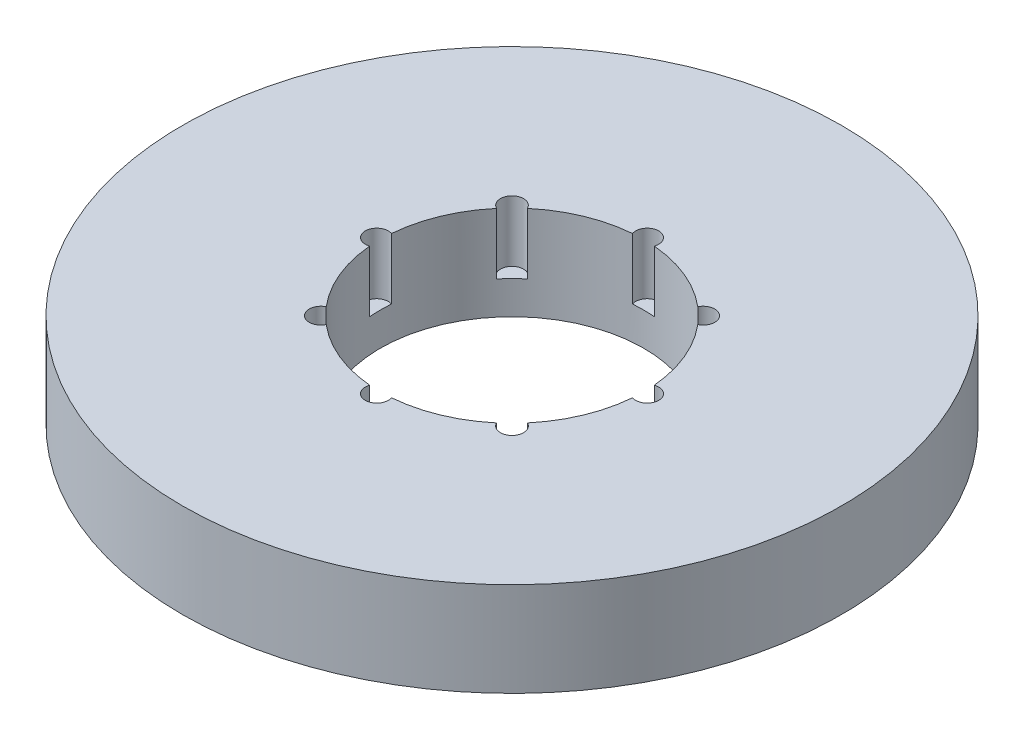
ISO-10303-21;
HEADER;
FILE_DESCRIPTION(('STEP AP214'),'2;1');
FILE_NAME('part.step','',(''),(''),'','','');
FILE_SCHEMA(('AUTOMOTIVE_DESIGN { 1 0 10303 214 1 1 1 1 }'));
ENDSEC;
DATA;
#1=APPLICATION_CONTEXT('core data for automotive mechanical design processes');
#2=APPLICATION_PROTOCOL_DEFINITION('international standard','automotive_design',2000,#1);
#3=PRODUCT_CONTEXT('',#1,'mechanical');
#4=PRODUCT('Part','Part','',(#3));
#5=PRODUCT_RELATED_PRODUCT_CATEGORY('part','',(#4));
#6=PRODUCT_DEFINITION_FORMATION('','',#4);
#7=PRODUCT_DEFINITION_CONTEXT('part definition',#1,'design');
#8=PRODUCT_DEFINITION('design','',#6,#7);
#9=PRODUCT_DEFINITION_SHAPE('','',#8);
#10=(LENGTH_UNIT() NAMED_UNIT(*) SI_UNIT(.MILLI.,.METRE.));
#11=(NAMED_UNIT(*) PLANE_ANGLE_UNIT() SI_UNIT($,.RADIAN.));
#12=(NAMED_UNIT(*) SI_UNIT($,.STERADIAN.) SOLID_ANGLE_UNIT());
#13=UNCERTAINTY_MEASURE_WITH_UNIT(LENGTH_MEASURE(1.E-05),#10,'distance_accuracy_value','');
#14=(GEOMETRIC_REPRESENTATION_CONTEXT(3) GLOBAL_UNCERTAINTY_ASSIGNED_CONTEXT((#13)) GLOBAL_UNIT_ASSIGNED_CONTEXT((#10,
#11,#12)) REPRESENTATION_CONTEXT('',''));
#15=CARTESIAN_POINT('',(0.,0.,0.));
#16=DIRECTION('',(0.,0.,1.));
#17=DIRECTION('',(1.,0.,0.));
#18=AXIS2_PLACEMENT_3D('',#15,#16,#17);
#19=CARTESIAN_POINT('',(0.,25.,0.));
#20=DIRECTION('',(0.,-1.,0.));
#21=DIRECTION('',(0.,0.,-1.));
#22=AXIS2_PLACEMENT_3D('',#19,#20,#21);
#23=CYLINDRICAL_SURFACE('',#22,87.5);
#24=CARTESIAN_POINT('',(0.,25.,0.));
#25=DIRECTION('',(0.,1.,0.));
#26=DIRECTION('',(0.,0.,1.));
#27=AXIS2_PLACEMENT_3D('',#24,#25,#26);
#28=CIRCLE('',#27,87.5);
#29=CARTESIAN_POINT('',(0.,25.,87.5));
#30=VERTEX_POINT('',#29);
#31=EDGE_CURVE('E195',#30,#30,#28,.T.);
#32=ORIENTED_EDGE('',*,*,#31,.F.);
#33=EDGE_LOOP('',(#32));
#34=FACE_BOUND('',#33,.T.);
#35=CARTESIAN_POINT('',(0.,0.,0.));
#36=DIRECTION('',(0.,1.,0.));
#37=DIRECTION('',(0.,0.,1.));
#38=AXIS2_PLACEMENT_3D('',#35,#36,#37);
#39=CIRCLE('',#38,87.5);
#40=CARTESIAN_POINT('',(0.,0.,87.5));
#41=VERTEX_POINT('',#40);
#42=EDGE_CURVE('E179',#41,#41,#39,.T.);
#43=ORIENTED_EDGE('',*,*,#42,.T.);
#44=EDGE_LOOP('',(#43));
#45=FACE_BOUND('',#44,.T.);
#46=ADVANCED_FACE('F39',(#34,#45),#23,.T.);
#47=CARTESIAN_POINT('',(0.,25.,0.));
#48=DIRECTION('',(0.,1.,0.));
#49=DIRECTION('',(0.,0.,1.));
#50=AXIS2_PLACEMENT_3D('',#47,#48,#49);
#51=PLANE('',#50);
#52=CARTESIAN_POINT('',(1.25330138786549E-13,25.,35.8959784181678));
#53=DIRECTION('',(0.,1.,0.));
#54=DIRECTION('',(1.,0.,0.));
#55=AXIS2_PLACEMENT_3D('',#52,#53,#54);
#56=CIRCLE('',#55,3.06589452444421);
#57=CARTESIAN_POINT('',(-2.89275118170886,25.,34.8802521579292));
#58=VERTEX_POINT('',#57);
#59=CARTESIAN_POINT('',(2.8927511817091,25.,34.8802521579292));
#60=VERTEX_POINT('',#59);
#61=EDGE_CURVE('E176',#58,#60,#56,.T.);
#62=ORIENTED_EDGE('',*,*,#61,.F.);
#63=CARTESIAN_POINT('',(0.,25.,0.));
#64=DIRECTION('',(0.,1.,0.));
#65=DIRECTION('',(0.,0.,1.));
#66=AXIS2_PLACEMENT_3D('',#63,#64,#65);
#67=CIRCLE('',#66,35.);
#68=CARTESIAN_POINT('',(-22.6185788534966,25.,26.7095468072403));
#69=VERTEX_POINT('',#68);
#70=EDGE_CURVE('E166',#69,#58,#67,.T.);
#71=ORIENTED_EDGE('',*,*,#70,.F.);
#72=CARTESIAN_POINT('',(-25.3822897568124,25.,25.3822897568124));
#73=DIRECTION('',(0.,1.,0.));
#74=DIRECTION('',(0.707106781186549,0.,0.707106781186546));
#75=AXIS2_PLACEMENT_3D('',#72,#73,#74);
#76=CIRCLE('',#75,3.06589452444421);
#77=CARTESIAN_POINT('',(-26.7095468072402,25.,22.6185788534966));
#78=VERTEX_POINT('',#77);
#79=EDGE_CURVE('E147',#78,#69,#76,.T.);
#80=ORIENTED_EDGE('',*,*,#79,.F.);
#81=CARTESIAN_POINT('',(-34.8802521579292,25.,2.89275118170898));
#82=VERTEX_POINT('',#81);
#83=EDGE_CURVE('E180',#82,#78,#67,.T.);
#84=ORIENTED_EDGE('',*,*,#83,.F.);
#85=CARTESIAN_POINT('',(-35.8959784181678,25.,0.));
#86=DIRECTION('',(0.,1.,0.));
#87=DIRECTION('',(0.,0.,1.));
#88=AXIS2_PLACEMENT_3D('',#85,#86,#87);
#89=CIRCLE('',#88,3.06589452444421);
#90=CARTESIAN_POINT('',(-34.8802521579292,25.,-2.89275118170898));
#91=VERTEX_POINT('',#90);
#92=EDGE_CURVE('E186',#91,#82,#89,.T.);
#93=ORIENTED_EDGE('',*,*,#92,.F.);
#94=CARTESIAN_POINT('',(-26.7095468072405,25.,-22.6185788534963));
#95=VERTEX_POINT('',#94);
#96=EDGE_CURVE('E182',#95,#91,#67,.T.);
#97=ORIENTED_EDGE('',*,*,#96,.F.);
#98=CARTESIAN_POINT('',(-25.3822897568127,25.,-25.3822897568121));
#99=DIRECTION('',(0.,1.,0.));
#100=DIRECTION('',(-0.707106781186539,0.,0.707106781186556));
#101=AXIS2_PLACEMENT_3D('',#98,#99,#100);
#102=CIRCLE('',#101,3.06589452444421);
#103=CARTESIAN_POINT('',(-22.6185788534969,25.,-26.70954680724));
#104=VERTEX_POINT('',#103);
#105=EDGE_CURVE('E446',#104,#95,#102,.T.);
#106=ORIENTED_EDGE('',*,*,#105,.F.);
#107=CARTESIAN_POINT('',(-2.89275118170935,25.,-34.8802521579291));
#108=VERTEX_POINT('',#107);
#109=EDGE_CURVE('E452',#108,#104,#67,.T.);
#110=ORIENTED_EDGE('',*,*,#109,.F.);
#111=CARTESIAN_POINT('',(-3.75990416359646E-13,25.,-35.8959784181678));
#112=DIRECTION('',(0.,1.,0.));
#113=DIRECTION('',(-1.,0.,0.));
#114=AXIS2_PLACEMENT_3D('',#111,#112,#113);
#115=CIRCLE('',#114,3.06589452444421);
#116=CARTESIAN_POINT('',(2.89275118170861,25.,-34.8802521579292));
#117=VERTEX_POINT('',#116);
#118=EDGE_CURVE('E477',#117,#108,#115,.T.);
#119=ORIENTED_EDGE('',*,*,#118,.F.);
#120=CARTESIAN_POINT('',(22.6185788534964,25.,-26.7095468072404));
#121=VERTEX_POINT('',#120);
#122=EDGE_CURVE('E460',#121,#117,#67,.T.);
#123=ORIENTED_EDGE('',*,*,#122,.F.);
#124=CARTESIAN_POINT('',(25.3822897568122,25.,-25.3822897568126));
#125=DIRECTION('',(0.,1.,0.));
#126=DIRECTION('',(-0.707106781186554,0.,-0.707106781186541));
#127=AXIS2_PLACEMENT_3D('',#124,#125,#126);
#128=CIRCLE('',#127,3.06589452444421);
#129=CARTESIAN_POINT('',(26.70954680724,25.,-22.6185788534968));
#130=VERTEX_POINT('',#129);
#131=EDGE_CURVE('E464',#130,#121,#128,.T.);
#132=ORIENTED_EDGE('',*,*,#131,.F.);
#133=CARTESIAN_POINT('',(34.8802521579292,25.,-2.89275118170898));
#134=VERTEX_POINT('',#133);
#135=EDGE_CURVE('E459',#134,#130,#67,.T.);
#136=ORIENTED_EDGE('',*,*,#135,.F.);
#137=CARTESIAN_POINT('',(35.8959784181678,25.,0.));
#138=DIRECTION('',(0.,1.,0.));
#139=DIRECTION('',(0.,0.,-1.));
#140=AXIS2_PLACEMENT_3D('',#137,#138,#139);
#141=CIRCLE('',#140,3.06589452444421);
#142=CARTESIAN_POINT('',(34.8802521579292,25.,2.89275118170898));
#143=VERTEX_POINT('',#142);
#144=EDGE_CURVE('E469',#143,#134,#141,.T.);
#145=ORIENTED_EDGE('',*,*,#144,.F.);
#146=CARTESIAN_POINT('',(26.7095468072404,25.,22.6185788534965));
#147=VERTEX_POINT('',#146);
#148=EDGE_CURVE('E181',#147,#143,#67,.T.);
#149=ORIENTED_EDGE('',*,*,#148,.F.);
#150=CARTESIAN_POINT('',(25.3822897568125,25.,25.3822897568123));
#151=DIRECTION('',(0.,1.,0.));
#152=DIRECTION('',(0.707106781186544,0.,-0.707106781186551));
#153=AXIS2_PLACEMENT_3D('',#150,#151,#152);
#154=CIRCLE('',#153,3.06589452444421);
#155=CARTESIAN_POINT('',(22.6185788534967,25.,26.7095468072401));
#156=VERTEX_POINT('',#155);
#157=EDGE_CURVE('E475',#156,#147,#154,.T.);
#158=ORIENTED_EDGE('',*,*,#157,.F.);
#159=EDGE_CURVE('E177',#60,#156,#67,.T.);
#160=ORIENTED_EDGE('',*,*,#159,.F.);
#161=EDGE_LOOP('',(#62,#71,#80,#84,#93,#97,#106,#110,#119,#123,#132,#136,#145,#149,#158,#160));
#162=FACE_BOUND('',#161,.T.);
#163=ORIENTED_EDGE('',*,*,#31,.T.);
#164=EDGE_LOOP('',(#163));
#165=FACE_BOUND('',#164,.T.);
#166=ADVANCED_FACE('F172',(#162,#165),#51,.T.);
#167=CARTESIAN_POINT('',(0.,0.,0.));
#168=DIRECTION('',(0.,1.,0.));
#169=DIRECTION('',(0.,0.,1.));
#170=AXIS2_PLACEMENT_3D('',#167,#168,#169);
#171=PLANE('',#170);
#172=CARTESIAN_POINT('',(0.,0.,0.));
#173=DIRECTION('',(0.,1.,0.));
#174=DIRECTION('',(0.,0.,1.));
#175=AXIS2_PLACEMENT_3D('',#172,#173,#174);
#176=CIRCLE('',#175,35.);
#177=CARTESIAN_POINT('',(0.,0.,35.));
#178=VERTEX_POINT('',#177);
#179=EDGE_CURVE('E187',#178,#178,#176,.T.);
#180=ORIENTED_EDGE('',*,*,#179,.T.);
#181=EDGE_LOOP('',(#180));
#182=FACE_BOUND('',#181,.T.);
#183=ORIENTED_EDGE('',*,*,#42,.F.);
#184=EDGE_LOOP('',(#183));
#185=FACE_BOUND('',#184,.T.);
#186=ADVANCED_FACE('F270',(#182,#185),#171,.F.);
#187=CARTESIAN_POINT('',(0.,25.,0.));
#188=DIRECTION('',(0.,-1.,0.));
#189=DIRECTION('',(0.,0.,-1.));
#190=AXIS2_PLACEMENT_3D('',#187,#188,#189);
#191=CYLINDRICAL_SURFACE('',#190,35.);
#192=DIRECTION('',(0.,1.,0.));
#193=VECTOR('',#192,1.);
#194=CARTESIAN_POINT('',(-2.89275118170886,16.8888974766412,34.8802521579292));
#195=LINE('',#194,#193);
#196=CARTESIAN_POINT('',(-2.89275118170886,8.77779495328235,34.8802521579292));
#197=VERTEX_POINT('',#196);
#198=EDGE_CURVE('E11',#197,#58,#195,.T.);
#199=ORIENTED_EDGE('',*,*,#198,.F.);
#200=CARTESIAN_POINT('',(0.,8.77779495328235,0.));
#201=DIRECTION('',(0.,1.,0.));
#202=DIRECTION('',(0.,0.,1.));
#203=AXIS2_PLACEMENT_3D('',#200,#201,#202);
#204=CIRCLE('',#203,35.);
#205=CARTESIAN_POINT('',(2.8927511817091,8.77779495328235,34.8802521579292));
#206=VERTEX_POINT('',#205);
#207=EDGE_CURVE('E250',#197,#206,#204,.T.);
#208=ORIENTED_EDGE('',*,*,#207,.T.);
#209=DIRECTION('',(0.,1.,0.));
#210=VECTOR('',#209,1.);
#211=CARTESIAN_POINT('',(2.8927511817091,16.8888974766412,34.8802521579291));
#212=LINE('',#211,#210);
#213=EDGE_CURVE('E46',#60,#206,#212,.F.);
#214=ORIENTED_EDGE('',*,*,#213,.F.);
#215=ORIENTED_EDGE('',*,*,#159,.T.);
#216=DIRECTION('',(0.,1.,0.));
#217=VECTOR('',#216,1.);
#218=CARTESIAN_POINT('',(22.6185788534967,16.8888974766412,26.7095468072401));
#219=LINE('',#218,#217);
#220=CARTESIAN_POINT('',(22.6185788534967,8.77779495328235,26.7095468072401));
#221=VERTEX_POINT('',#220);
#222=EDGE_CURVE('E244',#221,#156,#219,.T.);
#223=ORIENTED_EDGE('',*,*,#222,.F.);
#224=CARTESIAN_POINT('',(0.,8.77779495328235,0.));
#225=DIRECTION('',(0.,1.,0.));
#226=DIRECTION('',(0.,0.,1.));
#227=AXIS2_PLACEMENT_3D('',#224,#225,#226);
#228=CIRCLE('',#227,35.);
#229=CARTESIAN_POINT('',(26.7095468072404,8.77779495328235,22.6185788534965));
#230=VERTEX_POINT('',#229);
#231=EDGE_CURVE('E238',#221,#230,#228,.T.);
#232=ORIENTED_EDGE('',*,*,#231,.T.);
#233=DIRECTION('',(0.,1.,0.));
#234=VECTOR('',#233,1.);
#235=CARTESIAN_POINT('',(26.7095468072403,16.8888974766412,22.6185788534965));
#236=LINE('',#235,#234);
#237=EDGE_CURVE('E242',#147,#230,#236,.F.);
#238=ORIENTED_EDGE('',*,*,#237,.F.);
#239=ORIENTED_EDGE('',*,*,#148,.T.);
#240=DIRECTION('',(0.,1.,0.));
#241=VECTOR('',#240,1.);
#242=CARTESIAN_POINT('',(34.8802521579292,16.8888974766412,2.89275118170898));
#243=LINE('',#242,#241);
#244=CARTESIAN_POINT('',(34.8802521579292,8.77779495328235,2.89275118170898));
#245=VERTEX_POINT('',#244);
#246=EDGE_CURVE('E236',#245,#143,#243,.T.);
#247=ORIENTED_EDGE('',*,*,#246,.F.);
#248=CARTESIAN_POINT('',(0.,8.77779495328235,0.));
#249=DIRECTION('',(0.,1.,0.));
#250=DIRECTION('',(0.,0.,1.));
#251=AXIS2_PLACEMENT_3D('',#248,#249,#250);
#252=CIRCLE('',#251,35.);
#253=CARTESIAN_POINT('',(34.8802521579292,8.77779495328235,-2.89275118170898));
#254=VERTEX_POINT('',#253);
#255=EDGE_CURVE('E235',#245,#254,#252,.T.);
#256=ORIENTED_EDGE('',*,*,#255,.T.);
#257=DIRECTION('',(0.,1.,0.));
#258=VECTOR('',#257,1.);
#259=CARTESIAN_POINT('',(34.8802521579292,16.8888974766412,-2.89275118170898));
#260=LINE('',#259,#258);
#261=EDGE_CURVE('E234',#134,#254,#260,.F.);
#262=ORIENTED_EDGE('',*,*,#261,.F.);
#263=ORIENTED_EDGE('',*,*,#135,.T.);
#264=DIRECTION('',(0.,1.,0.));
#265=VECTOR('',#264,1.);
#266=CARTESIAN_POINT('',(26.70954680724,16.8888974766412,-22.6185788534968));
#267=LINE('',#266,#265);
#268=CARTESIAN_POINT('',(26.70954680724,8.77779495328235,-22.6185788534968));
#269=VERTEX_POINT('',#268);
#270=EDGE_CURVE('E229',#269,#130,#267,.T.);
#271=ORIENTED_EDGE('',*,*,#270,.F.);
#272=CARTESIAN_POINT('',(0.,8.77779495328235,0.));
#273=DIRECTION('',(0.,1.,0.));
#274=DIRECTION('',(0.,0.,1.));
#275=AXIS2_PLACEMENT_3D('',#272,#273,#274);
#276=CIRCLE('',#275,35.);
#277=CARTESIAN_POINT('',(22.6185788534964,8.77779495328235,-26.7095468072404));
#278=VERTEX_POINT('',#277);
#279=EDGE_CURVE('E221',#269,#278,#276,.T.);
#280=ORIENTED_EDGE('',*,*,#279,.T.);
#281=DIRECTION('',(0.,1.,0.));
#282=VECTOR('',#281,1.);
#283=CARTESIAN_POINT('',(22.6185788534964,16.8888974766412,-26.7095468072404));
#284=LINE('',#283,#282);
#285=EDGE_CURVE('E230',#121,#278,#284,.F.);
#286=ORIENTED_EDGE('',*,*,#285,.F.);
#287=ORIENTED_EDGE('',*,*,#122,.T.);
#288=DIRECTION('',(0.,1.,0.));
#289=VECTOR('',#288,1.);
#290=CARTESIAN_POINT('',(2.89275118170861,16.8888974766412,-34.8802521579292));
#291=LINE('',#290,#289);
#292=CARTESIAN_POINT('',(2.89275118170861,8.77779495328235,-34.8802521579292));
#293=VERTEX_POINT('',#292);
#294=EDGE_CURVE('E225',#293,#117,#291,.T.);
#295=ORIENTED_EDGE('',*,*,#294,.F.);
#296=CARTESIAN_POINT('',(0.,8.77779495328235,0.));
#297=DIRECTION('',(0.,1.,0.));
#298=DIRECTION('',(0.,0.,1.));
#299=AXIS2_PLACEMENT_3D('',#296,#297,#298);
#300=CIRCLE('',#299,35.);
#301=CARTESIAN_POINT('',(-2.89275118170935,8.77779495328235,-34.8802521579291));
#302=VERTEX_POINT('',#301);
#303=EDGE_CURVE('E216',#293,#302,#300,.T.);
#304=ORIENTED_EDGE('',*,*,#303,.T.);
#305=DIRECTION('',(0.,1.,0.));
#306=VECTOR('',#305,1.);
#307=CARTESIAN_POINT('',(-2.89275118170934,16.8888974766412,-34.8802521579291));
#308=LINE('',#307,#306);
#309=EDGE_CURVE('E218',#108,#302,#308,.F.);
#310=ORIENTED_EDGE('',*,*,#309,.F.);
#311=ORIENTED_EDGE('',*,*,#109,.T.);
#312=DIRECTION('',(0.,1.,0.));
#313=VECTOR('',#312,1.);
#314=CARTESIAN_POINT('',(-22.6185788534969,16.8888974766412,-26.70954680724));
#315=LINE('',#314,#313);
#316=CARTESIAN_POINT('',(-22.6185788534969,8.77779495328235,-26.70954680724));
#317=VERTEX_POINT('',#316);
#318=EDGE_CURVE('E212',#317,#104,#315,.T.);
#319=ORIENTED_EDGE('',*,*,#318,.F.);
#320=CARTESIAN_POINT('',(0.,8.77779495328235,0.));
#321=DIRECTION('',(0.,1.,0.));
#322=DIRECTION('',(0.,0.,1.));
#323=AXIS2_PLACEMENT_3D('',#320,#321,#322);
#324=CIRCLE('',#323,35.);
#325=CARTESIAN_POINT('',(-26.7095468072405,8.77779495328235,-22.6185788534963));
#326=VERTEX_POINT('',#325);
#327=EDGE_CURVE('E208',#317,#326,#324,.T.);
#328=ORIENTED_EDGE('',*,*,#327,.T.);
#329=DIRECTION('',(0.,1.,0.));
#330=VECTOR('',#329,1.);
#331=CARTESIAN_POINT('',(-26.7095468072405,16.8888974766412,-22.6185788534963));
#332=LINE('',#331,#330);
#333=EDGE_CURVE('E211',#95,#326,#332,.F.);
#334=ORIENTED_EDGE('',*,*,#333,.F.);
#335=ORIENTED_EDGE('',*,*,#96,.T.);
#336=DIRECTION('',(0.,1.,0.));
#337=VECTOR('',#336,1.);
#338=CARTESIAN_POINT('',(-34.8802521579292,16.8888974766412,-2.89275118170898));
#339=LINE('',#338,#337);
#340=CARTESIAN_POINT('',(-34.8802521579292,8.77779495328235,-2.89275118170898));
#341=VERTEX_POINT('',#340);
#342=EDGE_CURVE('E201',#341,#91,#339,.T.);
#343=ORIENTED_EDGE('',*,*,#342,.F.);
#344=CARTESIAN_POINT('',(0.,8.77779495328235,0.));
#345=DIRECTION('',(0.,1.,0.));
#346=DIRECTION('',(0.,0.,1.));
#347=AXIS2_PLACEMENT_3D('',#344,#345,#346);
#348=CIRCLE('',#347,35.);
#349=CARTESIAN_POINT('',(-34.8802521579292,8.77779495328235,2.89275118170898));
#350=VERTEX_POINT('',#349);
#351=EDGE_CURVE('E194',#341,#350,#348,.T.);
#352=ORIENTED_EDGE('',*,*,#351,.T.);
#353=DIRECTION('',(0.,1.,0.));
#354=VECTOR('',#353,1.);
#355=CARTESIAN_POINT('',(-34.8802521579292,16.8888974766412,2.89275118170898));
#356=LINE('',#355,#354);
#357=EDGE_CURVE('E199',#82,#350,#356,.F.);
#358=ORIENTED_EDGE('',*,*,#357,.F.);
#359=ORIENTED_EDGE('',*,*,#83,.T.);
#360=DIRECTION('',(0.,1.,0.));
#361=VECTOR('',#360,1.);
#362=CARTESIAN_POINT('',(-26.7095468072402,16.8888974766412,22.6185788534966));
#363=LINE('',#362,#361);
#364=CARTESIAN_POINT('',(-26.7095468072402,8.77779495328235,22.6185788534966));
#365=VERTEX_POINT('',#364);
#366=EDGE_CURVE('E160',#365,#78,#363,.T.);
#367=ORIENTED_EDGE('',*,*,#366,.F.);
#368=CARTESIAN_POINT('',(0.,8.77779495328235,0.));
#369=DIRECTION('',(0.,1.,0.));
#370=DIRECTION('',(0.,0.,1.));
#371=AXIS2_PLACEMENT_3D('',#368,#369,#370);
#372=CIRCLE('',#371,35.);
#373=CARTESIAN_POINT('',(-22.6185788534966,8.77779495328235,26.7095468072403));
#374=VERTEX_POINT('',#373);
#375=EDGE_CURVE('E168',#365,#374,#372,.T.);
#376=ORIENTED_EDGE('',*,*,#375,.T.);
#377=DIRECTION('',(0.,1.,0.));
#378=VECTOR('',#377,1.);
#379=CARTESIAN_POINT('',(-22.6185788534966,16.8888974766412,26.7095468072403));
#380=LINE('',#379,#378);
#381=EDGE_CURVE('E152',#69,#374,#380,.F.);
#382=ORIENTED_EDGE('',*,*,#381,.F.);
#383=ORIENTED_EDGE('',*,*,#70,.T.);
#384=EDGE_LOOP('',(#199,#208,#214,#215,#223,#232,#238,#239,#247,#256,#262,#263,#271,#280,#286,
#287,#295,#304,#310,#311,#319,#328,#334,#335,#343,#352,#358,#359,#367,#376,#382,#383));
#385=FACE_BOUND('',#384,.T.);
#386=ORIENTED_EDGE('',*,*,#179,.F.);
#387=EDGE_LOOP('',(#386));
#388=FACE_BOUND('',#387,.T.);
#389=ADVANCED_FACE('F170',(#385,#388),#191,.F.);
#390=CARTESIAN_POINT('',(-35.8959784181678,8.77779495328235,0.));
#391=DIRECTION('',(0.,1.,0.));
#392=DIRECTION('',(0.,0.,1.));
#393=AXIS2_PLACEMENT_3D('',#390,#391,#392);
#394=CYLINDRICAL_SURFACE('',#393,3.06589452444421);
#395=ORIENTED_EDGE('',*,*,#342,.T.);
#396=ORIENTED_EDGE('',*,*,#92,.T.);
#397=ORIENTED_EDGE('',*,*,#357,.T.);
#398=CARTESIAN_POINT('',(-35.8959784181678,8.77779495328235,0.));
#399=DIRECTION('',(0.,1.,0.));
#400=DIRECTION('',(0.,0.,1.));
#401=AXIS2_PLACEMENT_3D('',#398,#399,#400);
#402=CIRCLE('',#401,3.06589452444421);
#403=EDGE_CURVE('E191',#341,#350,#402,.T.);
#404=ORIENTED_EDGE('',*,*,#403,.F.);
#405=EDGE_LOOP('',(#395,#396,#397,#404));
#406=FACE_BOUND('',#405,.T.);
#407=ADVANCED_FACE('F279',(#406),#394,.F.);
#408=CARTESIAN_POINT('',(-35.8959784181678,8.77779495328235,0.));
#409=DIRECTION('',(0.,1.,0.));
#410=DIRECTION('',(0.,0.,1.));
#411=AXIS2_PLACEMENT_3D('',#408,#409,#410);
#412=PLANE('',#411);
#413=ORIENTED_EDGE('',*,*,#403,.T.);
#414=ORIENTED_EDGE('',*,*,#351,.F.);
#415=EDGE_LOOP('',(#413,#414));
#416=FACE_BOUND('',#415,.T.);
#417=ADVANCED_FACE('F285',(#416),#412,.T.);
#418=CARTESIAN_POINT('',(-25.3822897568124,8.77779495328235,25.3822897568124));
#419=DIRECTION('',(0.,1.,0.));
#420=DIRECTION('',(0.,0.,1.));
#421=AXIS2_PLACEMENT_3D('',#418,#419,#420);
#422=CYLINDRICAL_SURFACE('',#421,3.06589452444421);
#423=ORIENTED_EDGE('',*,*,#366,.T.);
#424=ORIENTED_EDGE('',*,*,#79,.T.);
#425=ORIENTED_EDGE('',*,*,#381,.T.);
#426=CARTESIAN_POINT('',(-25.3822897568124,8.77779495328235,25.3822897568124));
#427=DIRECTION('',(0.,1.,0.));
#428=DIRECTION('',(0.707106781186549,0.,0.707106781186546));
#429=AXIS2_PLACEMENT_3D('',#426,#427,#428);
#430=CIRCLE('',#429,3.06589452444421);
#431=EDGE_CURVE('E165',#365,#374,#430,.T.);
#432=ORIENTED_EDGE('',*,*,#431,.F.);
#433=EDGE_LOOP('',(#423,#424,#425,#432));
#434=FACE_BOUND('',#433,.T.);
#435=ADVANCED_FACE('F155',(#434),#422,.F.);
#436=CARTESIAN_POINT('',(-25.3822897568124,8.77779495328235,25.3822897568124));
#437=DIRECTION('',(0.,1.,0.));
#438=DIRECTION('',(0.707106781186549,0.,0.707106781186546));
#439=AXIS2_PLACEMENT_3D('',#436,#437,#438);
#440=PLANE('',#439);
#441=ORIENTED_EDGE('',*,*,#431,.T.);
#442=ORIENTED_EDGE('',*,*,#375,.F.);
#443=EDGE_LOOP('',(#441,#442));
#444=FACE_BOUND('',#443,.T.);
#445=ADVANCED_FACE('F288',(#444),#440,.T.);
#446=CARTESIAN_POINT('',(-25.3822897568127,8.77779495328235,-25.3822897568121));
#447=DIRECTION('',(0.,1.,0.));
#448=DIRECTION('',(0.,0.,1.));
#449=AXIS2_PLACEMENT_3D('',#446,#447,#448);
#450=CYLINDRICAL_SURFACE('',#449,3.06589452444421);
#451=ORIENTED_EDGE('',*,*,#318,.T.);
#452=ORIENTED_EDGE('',*,*,#105,.T.);
#453=ORIENTED_EDGE('',*,*,#333,.T.);
#454=CARTESIAN_POINT('',(-25.3822897568127,8.77779495328235,-25.3822897568121));
#455=DIRECTION('',(0.,1.,0.));
#456=DIRECTION('',(-0.707106781186539,0.,0.707106781186556));
#457=AXIS2_PLACEMENT_3D('',#454,#455,#456);
#458=CIRCLE('',#457,3.06589452444421);
#459=EDGE_CURVE('E447',#317,#326,#458,.T.);
#460=ORIENTED_EDGE('',*,*,#459,.F.);
#461=EDGE_LOOP('',(#451,#452,#453,#460));
#462=FACE_BOUND('',#461,.T.);
#463=ADVANCED_FACE('F295',(#462),#450,.F.);
#464=CARTESIAN_POINT('',(-25.3822897568127,8.77779495328235,-25.3822897568121));
#465=DIRECTION('',(0.,1.,0.));
#466=DIRECTION('',(-0.707106781186539,0.,0.707106781186556));
#467=AXIS2_PLACEMENT_3D('',#464,#465,#466);
#468=PLANE('',#467);
#469=ORIENTED_EDGE('',*,*,#459,.T.);
#470=ORIENTED_EDGE('',*,*,#327,.F.);
#471=EDGE_LOOP('',(#469,#470));
#472=FACE_BOUND('',#471,.T.);
#473=ADVANCED_FACE('F375',(#472),#468,.T.);
#474=CARTESIAN_POINT('',(-3.75990416359646E-13,8.77779495328235,-35.8959784181678));
#475=DIRECTION('',(0.,1.,0.));
#476=DIRECTION('',(0.,0.,1.));
#477=AXIS2_PLACEMENT_3D('',#474,#475,#476);
#478=CYLINDRICAL_SURFACE('',#477,3.06589452444421);
#479=ORIENTED_EDGE('',*,*,#294,.T.);
#480=ORIENTED_EDGE('',*,*,#118,.T.);
#481=ORIENTED_EDGE('',*,*,#309,.T.);
#482=CARTESIAN_POINT('',(-3.75990416359646E-13,8.77779495328235,-35.8959784181678));
#483=DIRECTION('',(0.,1.,0.));
#484=DIRECTION('',(-1.,0.,0.));
#485=AXIS2_PLACEMENT_3D('',#482,#483,#484);
#486=CIRCLE('',#485,3.06589452444421);
#487=EDGE_CURVE('E467',#293,#302,#486,.T.);
#488=ORIENTED_EDGE('',*,*,#487,.F.);
#489=EDGE_LOOP('',(#479,#480,#481,#488));
#490=FACE_BOUND('',#489,.T.);
#491=ADVANCED_FACE('F361',(#490),#478,.F.);
#492=CARTESIAN_POINT('',(-3.75990416359646E-13,8.77779495328235,-35.8959784181678));
#493=DIRECTION('',(0.,1.,0.));
#494=DIRECTION('',(-1.,0.,0.));
#495=AXIS2_PLACEMENT_3D('',#492,#493,#494);
#496=PLANE('',#495);
#497=ORIENTED_EDGE('',*,*,#487,.T.);
#498=ORIENTED_EDGE('',*,*,#303,.F.);
#499=EDGE_LOOP('',(#497,#498));
#500=FACE_BOUND('',#499,.T.);
#501=ADVANCED_FACE('F297',(#500),#496,.T.);
#502=CARTESIAN_POINT('',(25.3822897568122,8.77779495328235,-25.3822897568126));
#503=DIRECTION('',(0.,1.,0.));
#504=DIRECTION('',(0.,0.,1.));
#505=AXIS2_PLACEMENT_3D('',#502,#503,#504);
#506=CYLINDRICAL_SURFACE('',#505,3.06589452444421);
#507=ORIENTED_EDGE('',*,*,#270,.T.);
#508=ORIENTED_EDGE('',*,*,#131,.T.);
#509=ORIENTED_EDGE('',*,*,#285,.T.);
#510=CARTESIAN_POINT('',(25.3822897568122,8.77779495328235,-25.3822897568126));
#511=DIRECTION('',(0.,1.,0.));
#512=DIRECTION('',(-0.707106781186554,0.,-0.707106781186541));
#513=AXIS2_PLACEMENT_3D('',#510,#511,#512);
#514=CIRCLE('',#513,3.06589452444421);
#515=EDGE_CURVE('E470',#269,#278,#514,.T.);
#516=ORIENTED_EDGE('',*,*,#515,.F.);
#517=EDGE_LOOP('',(#507,#508,#509,#516));
#518=FACE_BOUND('',#517,.T.);
#519=ADVANCED_FACE('F294',(#518),#506,.F.);
#520=CARTESIAN_POINT('',(25.3822897568122,8.77779495328235,-25.3822897568126));
#521=DIRECTION('',(0.,1.,0.));
#522=DIRECTION('',(-0.707106781186554,0.,-0.707106781186541));
#523=AXIS2_PLACEMENT_3D('',#520,#521,#522);
#524=PLANE('',#523);
#525=ORIENTED_EDGE('',*,*,#515,.T.);
#526=ORIENTED_EDGE('',*,*,#279,.F.);
#527=EDGE_LOOP('',(#525,#526));
#528=FACE_BOUND('',#527,.T.);
#529=ADVANCED_FACE('F300',(#528),#524,.T.);
#530=CARTESIAN_POINT('',(35.8959784181678,8.77779495328235,0.));
#531=DIRECTION('',(0.,1.,0.));
#532=DIRECTION('',(0.,0.,1.));
#533=AXIS2_PLACEMENT_3D('',#530,#531,#532);
#534=CYLINDRICAL_SURFACE('',#533,3.06589452444421);
#535=ORIENTED_EDGE('',*,*,#246,.T.);
#536=ORIENTED_EDGE('',*,*,#144,.T.);
#537=ORIENTED_EDGE('',*,*,#261,.T.);
#538=CARTESIAN_POINT('',(35.8959784181678,8.77779495328235,0.));
#539=DIRECTION('',(0.,1.,0.));
#540=DIRECTION('',(0.,0.,-1.));
#541=AXIS2_PLACEMENT_3D('',#538,#539,#540);
#542=CIRCLE('',#541,3.06589452444421);
#543=EDGE_CURVE('E472',#245,#254,#542,.T.);
#544=ORIENTED_EDGE('',*,*,#543,.F.);
#545=EDGE_LOOP('',(#535,#536,#537,#544));
#546=FACE_BOUND('',#545,.T.);
#547=ADVANCED_FACE('F305',(#546),#534,.F.);
#548=CARTESIAN_POINT('',(35.8959784181678,8.77779495328235,0.));
#549=DIRECTION('',(0.,1.,0.));
#550=DIRECTION('',(0.,0.,-1.));
#551=AXIS2_PLACEMENT_3D('',#548,#549,#550);
#552=PLANE('',#551);
#553=ORIENTED_EDGE('',*,*,#543,.T.);
#554=ORIENTED_EDGE('',*,*,#255,.F.);
#555=EDGE_LOOP('',(#553,#554));
#556=FACE_BOUND('',#555,.T.);
#557=ADVANCED_FACE('F308',(#556),#552,.T.);
#558=CARTESIAN_POINT('',(25.3822897568125,8.77779495328235,25.3822897568123));
#559=DIRECTION('',(0.,1.,0.));
#560=DIRECTION('',(0.,0.,1.));
#561=AXIS2_PLACEMENT_3D('',#558,#559,#560);
#562=CYLINDRICAL_SURFACE('',#561,3.06589452444421);
#563=ORIENTED_EDGE('',*,*,#222,.T.);
#564=ORIENTED_EDGE('',*,*,#157,.T.);
#565=ORIENTED_EDGE('',*,*,#237,.T.);
#566=CARTESIAN_POINT('',(25.3822897568125,8.77779495328235,25.3822897568123));
#567=DIRECTION('',(0.,1.,0.));
#568=DIRECTION('',(0.707106781186544,0.,-0.707106781186551));
#569=AXIS2_PLACEMENT_3D('',#566,#567,#568);
#570=CIRCLE('',#569,3.06589452444421);
#571=EDGE_CURVE('E56',#221,#230,#570,.T.);
#572=ORIENTED_EDGE('',*,*,#571,.F.);
#573=EDGE_LOOP('',(#563,#564,#565,#572));
#574=FACE_BOUND('',#573,.T.);
#575=ADVANCED_FACE('F309',(#574),#562,.F.);
#576=CARTESIAN_POINT('',(25.3822897568125,8.77779495328235,25.3822897568123));
#577=DIRECTION('',(0.,1.,0.));
#578=DIRECTION('',(0.707106781186544,0.,-0.707106781186551));
#579=AXIS2_PLACEMENT_3D('',#576,#577,#578);
#580=PLANE('',#579);
#581=ORIENTED_EDGE('',*,*,#571,.T.);
#582=ORIENTED_EDGE('',*,*,#231,.F.);
#583=EDGE_LOOP('',(#581,#582));
#584=FACE_BOUND('',#583,.T.);
#585=ADVANCED_FACE('F256',(#584),#580,.T.);
#586=CARTESIAN_POINT('',(1.25330138786549E-13,8.77779495328235,35.8959784181678));
#587=DIRECTION('',(0.,1.,0.));
#588=DIRECTION('',(0.,0.,1.));
#589=AXIS2_PLACEMENT_3D('',#586,#587,#588);
#590=CYLINDRICAL_SURFACE('',#589,3.06589452444421);
#591=ORIENTED_EDGE('',*,*,#198,.T.);
#592=ORIENTED_EDGE('',*,*,#61,.T.);
#593=ORIENTED_EDGE('',*,*,#213,.T.);
#594=CARTESIAN_POINT('',(1.25330138786549E-13,8.77779495328235,35.8959784181678));
#595=DIRECTION('',(0.,1.,0.));
#596=DIRECTION('',(1.,0.,0.));
#597=AXIS2_PLACEMENT_3D('',#594,#595,#596);
#598=CIRCLE('',#597,3.06589452444421);
#599=EDGE_CURVE('E55',#197,#206,#598,.T.);
#600=ORIENTED_EDGE('',*,*,#599,.F.);
#601=EDGE_LOOP('',(#591,#592,#593,#600));
#602=FACE_BOUND('',#601,.T.);
#603=ADVANCED_FACE('F253',(#602),#590,.F.);
#604=CARTESIAN_POINT('',(1.25330138786549E-13,8.77779495328235,35.8959784181678));
#605=DIRECTION('',(0.,1.,0.));
#606=DIRECTION('',(1.,0.,0.));
#607=AXIS2_PLACEMENT_3D('',#604,#605,#606);
#608=PLANE('',#607);
#609=ORIENTED_EDGE('',*,*,#599,.T.);
#610=ORIENTED_EDGE('',*,*,#207,.F.);
#611=EDGE_LOOP('',(#609,#610));
#612=FACE_BOUND('',#611,.T.);
#613=ADVANCED_FACE('F252',(#612),#608,.T.);
#614=CLOSED_SHELL('',(#46,#166,#186,#389,#407,#417,#435,#445,#463,#473,#491,#501,#519,#529,#547,
#557,#575,#585,#603,#613));
#615=MANIFOLD_SOLID_BREP('B2',#614);
#616=ADVANCED_BREP_SHAPE_REPRESENTATION('',(#18,#615),#14);
#617=SHAPE_DEFINITION_REPRESENTATION(#9,#616);
ENDSEC;
END-ISO-10303-21;
